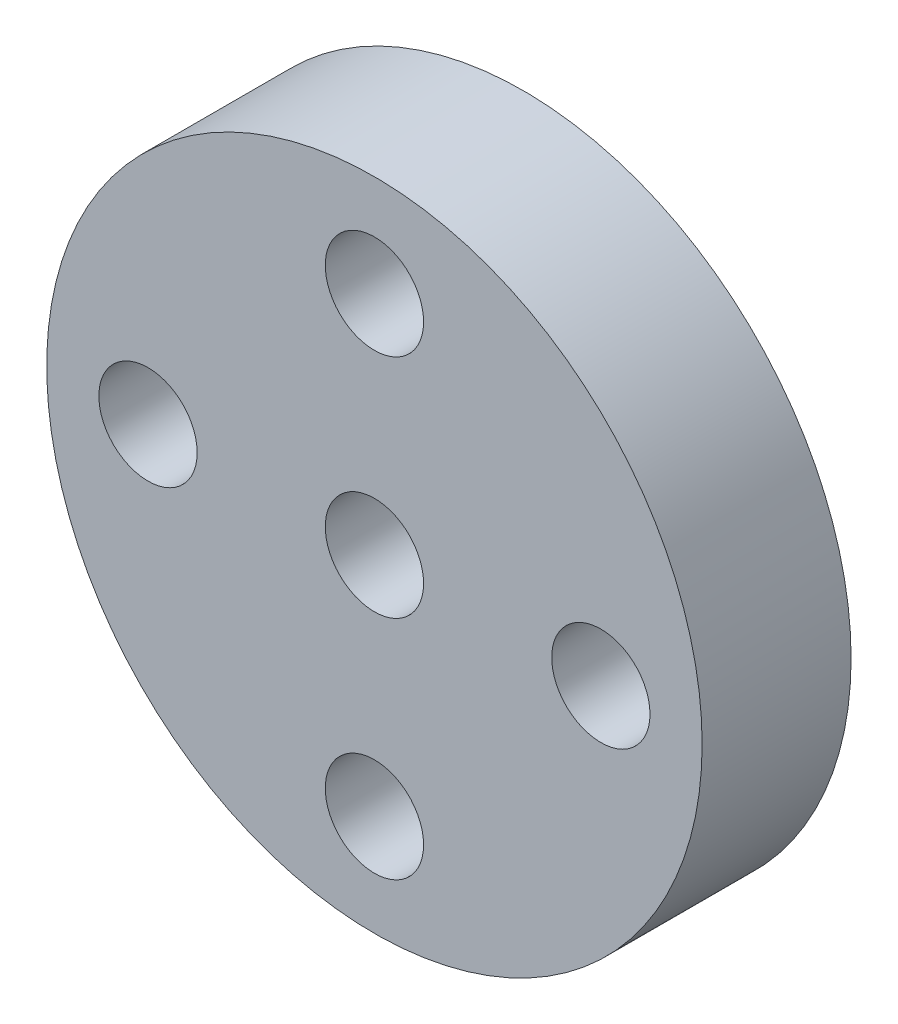
ISO-10303-21;
HEADER;
FILE_DESCRIPTION(('STEP AP214'),'2;1');
FILE_NAME('part.step','',(''),(''),'','','');
FILE_SCHEMA(('AUTOMOTIVE_DESIGN { 1 0 10303 214 1 1 1 1 }'));
ENDSEC;
DATA;
#1=APPLICATION_CONTEXT('core data for automotive mechanical design processes');
#2=APPLICATION_PROTOCOL_DEFINITION('international standard','automotive_design',2000,#1);
#3=PRODUCT_CONTEXT('',#1,'mechanical');
#4=PRODUCT('Part','Part','',(#3));
#5=PRODUCT_RELATED_PRODUCT_CATEGORY('part','',(#4));
#6=PRODUCT_DEFINITION_FORMATION('','',#4);
#7=PRODUCT_DEFINITION_CONTEXT('part definition',#1,'design');
#8=PRODUCT_DEFINITION('design','',#6,#7);
#9=PRODUCT_DEFINITION_SHAPE('','',#8);
#10=(LENGTH_UNIT() NAMED_UNIT(*) SI_UNIT(.MILLI.,.METRE.));
#11=(NAMED_UNIT(*) PLANE_ANGLE_UNIT() SI_UNIT($,.RADIAN.));
#12=(NAMED_UNIT(*) SI_UNIT($,.STERADIAN.) SOLID_ANGLE_UNIT());
#13=UNCERTAINTY_MEASURE_WITH_UNIT(LENGTH_MEASURE(1.E-05),#10,'distance_accuracy_value','');
#14=(GEOMETRIC_REPRESENTATION_CONTEXT(3) GLOBAL_UNCERTAINTY_ASSIGNED_CONTEXT((#13)) GLOBAL_UNIT_ASSIGNED_CONTEXT((#10,
#11,#12)) REPRESENTATION_CONTEXT('',''));
#15=CARTESIAN_POINT('',(0.,0.,0.));
#16=DIRECTION('',(0.,0.,1.));
#17=DIRECTION('',(1.,0.,0.));
#18=AXIS2_PLACEMENT_3D('',#15,#16,#17);
#19=CARTESIAN_POINT('',(-8.43731841304004,0.250726347839904,5.));
#20=DIRECTION('',(0.,0.,-1.));
#21=DIRECTION('',(-1.,0.,0.));
#22=AXIS2_PLACEMENT_3D('',#19,#20,#21);
#23=CYLINDRICAL_SURFACE('',#22,11.);
#24=CARTESIAN_POINT('',(-8.43731841304004,0.250726347839904,5.));
#25=DIRECTION('',(0.,0.,1.));
#26=DIRECTION('',(1.,0.,0.));
#27=AXIS2_PLACEMENT_3D('',#24,#25,#26);
#28=CIRCLE('',#27,11.);
#29=CARTESIAN_POINT('',(2.56268158695995,0.250726347839904,5.));
#30=VERTEX_POINT('',#29);
#31=EDGE_CURVE('E10',#30,#30,#28,.T.);
#32=ORIENTED_EDGE('',*,*,#31,.F.);
#33=EDGE_LOOP('',(#32));
#34=FACE_BOUND('',#33,.T.);
#35=CARTESIAN_POINT('',(-8.43731841304004,0.250726347839904,0.));
#36=DIRECTION('',(0.,0.,1.));
#37=DIRECTION('',(1.,0.,0.));
#38=AXIS2_PLACEMENT_3D('',#35,#36,#37);
#39=CIRCLE('',#38,11.);
#40=CARTESIAN_POINT('',(2.56268158695995,0.250726347839904,0.));
#41=VERTEX_POINT('',#40);
#42=EDGE_CURVE('E42',#41,#41,#39,.T.);
#43=ORIENTED_EDGE('',*,*,#42,.T.);
#44=EDGE_LOOP('',(#43));
#45=FACE_BOUND('',#44,.T.);
#46=ADVANCED_FACE('F35',(#34,#45),#23,.T.);
#47=CARTESIAN_POINT('',(0.,0.,5.));
#48=DIRECTION('',(0.,0.,1.));
#49=DIRECTION('',(1.,0.,0.));
#50=AXIS2_PLACEMENT_3D('',#47,#48,#49);
#51=PLANE('',#50);
#52=CARTESIAN_POINT('',(-0.837318413040043,0.250726347839904,5.));
#53=DIRECTION('',(0.,0.,1.));
#54=DIRECTION('',(1.,0.,0.));
#55=AXIS2_PLACEMENT_3D('',#52,#53,#54);
#56=CIRCLE('',#55,1.65);
#57=CARTESIAN_POINT('',(0.812681586959958,0.250726347839904,5.));
#58=VERTEX_POINT('',#57);
#59=EDGE_CURVE('E56',#58,#58,#56,.T.);
#60=ORIENTED_EDGE('',*,*,#59,.F.);
#61=EDGE_LOOP('',(#60));
#62=FACE_BOUND('',#61,.T.);
#63=CARTESIAN_POINT('',(-8.43731841304004,-7.3492736521601,5.));
#64=DIRECTION('',(0.,0.,1.));
#65=DIRECTION('',(1.,0.,0.));
#66=AXIS2_PLACEMENT_3D('',#63,#64,#65);
#67=CIRCLE('',#66,1.65);
#68=CARTESIAN_POINT('',(-6.78731841304004,-7.3492736521601,5.));
#69=VERTEX_POINT('',#68);
#70=EDGE_CURVE('E122',#69,#69,#67,.T.);
#71=ORIENTED_EDGE('',*,*,#70,.F.);
#72=EDGE_LOOP('',(#71));
#73=FACE_BOUND('',#72,.T.);
#74=CARTESIAN_POINT('',(-16.03731841304,0.250726347839902,5.));
#75=DIRECTION('',(0.,0.,1.));
#76=DIRECTION('',(1.,0.,0.));
#77=AXIS2_PLACEMENT_3D('',#74,#75,#76);
#78=CIRCLE('',#77,1.65);
#79=CARTESIAN_POINT('',(-14.38731841304,0.250726347839902,5.));
#80=VERTEX_POINT('',#79);
#81=EDGE_CURVE('E112',#80,#80,#78,.T.);
#82=ORIENTED_EDGE('',*,*,#81,.F.);
#83=EDGE_LOOP('',(#82));
#84=FACE_BOUND('',#83,.T.);
#85=CARTESIAN_POINT('',(-8.43731841304004,7.85072634783991,5.));
#86=DIRECTION('',(0.,0.,1.));
#87=DIRECTION('',(1.,0.,0.));
#88=AXIS2_PLACEMENT_3D('',#85,#86,#87);
#89=CIRCLE('',#88,1.65);
#90=CARTESIAN_POINT('',(-6.78731841304004,7.85072634783991,5.));
#91=VERTEX_POINT('',#90);
#92=EDGE_CURVE('E49',#91,#91,#89,.T.);
#93=ORIENTED_EDGE('',*,*,#92,.F.);
#94=EDGE_LOOP('',(#93));
#95=FACE_BOUND('',#94,.T.);
#96=CARTESIAN_POINT('',(-8.43731841304004,0.250726347839904,5.));
#97=DIRECTION('',(0.,0.,1.));
#98=DIRECTION('',(1.,0.,0.));
#99=AXIS2_PLACEMENT_3D('',#96,#97,#98);
#100=CIRCLE('',#99,1.65);
#101=CARTESIAN_POINT('',(-6.78731841304004,0.250726347839904,5.));
#102=VERTEX_POINT('',#101);
#103=EDGE_CURVE('E125',#102,#102,#100,.T.);
#104=ORIENTED_EDGE('',*,*,#103,.F.);
#105=EDGE_LOOP('',(#104));
#106=FACE_BOUND('',#105,.T.);
#107=ORIENTED_EDGE('',*,*,#31,.T.);
#108=EDGE_LOOP('',(#107));
#109=FACE_BOUND('',#108,.T.);
#110=ADVANCED_FACE('F84',(#62,#73,#84,#95,#106,#109),#51,.T.);
#111=CARTESIAN_POINT('',(0.,0.,0.));
#112=DIRECTION('',(0.,0.,1.));
#113=DIRECTION('',(1.,0.,0.));
#114=AXIS2_PLACEMENT_3D('',#111,#112,#113);
#115=PLANE('',#114);
#116=CARTESIAN_POINT('',(-0.837318413040043,0.250726347839904,0.));
#117=DIRECTION('',(0.,0.,1.));
#118=DIRECTION('',(1.,0.,0.));
#119=AXIS2_PLACEMENT_3D('',#116,#117,#118);
#120=CIRCLE('',#119,1.65);
#121=CARTESIAN_POINT('',(0.812681586959958,0.250726347839904,0.));
#122=VERTEX_POINT('',#121);
#123=EDGE_CURVE('E38',#122,#122,#120,.T.);
#124=ORIENTED_EDGE('',*,*,#123,.T.);
#125=EDGE_LOOP('',(#124));
#126=FACE_BOUND('',#125,.T.);
#127=CARTESIAN_POINT('',(-8.43731841304004,-7.3492736521601,0.));
#128=DIRECTION('',(0.,0.,1.));
#129=DIRECTION('',(1.,0.,0.));
#130=AXIS2_PLACEMENT_3D('',#127,#128,#129);
#131=CIRCLE('',#130,1.65);
#132=CARTESIAN_POINT('',(-6.78731841304004,-7.3492736521601,0.));
#133=VERTEX_POINT('',#132);
#134=EDGE_CURVE('E61',#133,#133,#131,.T.);
#135=ORIENTED_EDGE('',*,*,#134,.T.);
#136=EDGE_LOOP('',(#135));
#137=FACE_BOUND('',#136,.T.);
#138=CARTESIAN_POINT('',(-16.03731841304,0.250726347839902,0.));
#139=DIRECTION('',(0.,0.,1.));
#140=DIRECTION('',(1.,0.,0.));
#141=AXIS2_PLACEMENT_3D('',#138,#139,#140);
#142=CIRCLE('',#141,1.65);
#143=CARTESIAN_POINT('',(-14.38731841304,0.250726347839902,0.));
#144=VERTEX_POINT('',#143);
#145=EDGE_CURVE('E59',#144,#144,#142,.T.);
#146=ORIENTED_EDGE('',*,*,#145,.T.);
#147=EDGE_LOOP('',(#146));
#148=FACE_BOUND('',#147,.T.);
#149=CARTESIAN_POINT('',(-8.43731841304004,7.85072634783991,0.));
#150=DIRECTION('',(0.,0.,1.));
#151=DIRECTION('',(1.,0.,0.));
#152=AXIS2_PLACEMENT_3D('',#149,#150,#151);
#153=CIRCLE('',#152,1.65);
#154=CARTESIAN_POINT('',(-6.78731841304004,7.85072634783991,0.));
#155=VERTEX_POINT('',#154);
#156=EDGE_CURVE('E55',#155,#155,#153,.T.);
#157=ORIENTED_EDGE('',*,*,#156,.T.);
#158=EDGE_LOOP('',(#157));
#159=FACE_BOUND('',#158,.T.);
#160=CARTESIAN_POINT('',(-8.43731841304004,0.250726347839904,0.));
#161=DIRECTION('',(0.,0.,1.));
#162=DIRECTION('',(1.,0.,0.));
#163=AXIS2_PLACEMENT_3D('',#160,#161,#162);
#164=CIRCLE('',#163,1.65);
#165=CARTESIAN_POINT('',(-6.78731841304004,0.250726347839904,0.));
#166=VERTEX_POINT('',#165);
#167=EDGE_CURVE('E52',#166,#166,#164,.T.);
#168=ORIENTED_EDGE('',*,*,#167,.T.);
#169=EDGE_LOOP('',(#168));
#170=FACE_BOUND('',#169,.T.);
#171=ORIENTED_EDGE('',*,*,#42,.F.);
#172=EDGE_LOOP('',(#171));
#173=FACE_BOUND('',#172,.T.);
#174=ADVANCED_FACE('F68',(#126,#137,#148,#159,#170,#173),#115,.F.);
#175=CARTESIAN_POINT('',(-8.43731841304004,0.250726347839904,-16.));
#176=DIRECTION('',(0.,0.,1.));
#177=DIRECTION('',(1.,0.,0.));
#178=AXIS2_PLACEMENT_3D('',#175,#176,#177);
#179=CYLINDRICAL_SURFACE('',#178,1.65);
#180=ORIENTED_EDGE('',*,*,#103,.T.);
#181=EDGE_LOOP('',(#180));
#182=FACE_BOUND('',#181,.T.);
#183=ORIENTED_EDGE('',*,*,#167,.F.);
#184=EDGE_LOOP('',(#183));
#185=FACE_BOUND('',#184,.T.);
#186=ADVANCED_FACE('F95',(#182,#185),#179,.F.);
#187=CARTESIAN_POINT('',(-8.43731841304004,7.85072634783991,-16.));
#188=DIRECTION('',(0.,0.,1.));
#189=DIRECTION('',(1.,0.,0.));
#190=AXIS2_PLACEMENT_3D('',#187,#188,#189);
#191=CYLINDRICAL_SURFACE('',#190,1.65);
#192=ORIENTED_EDGE('',*,*,#92,.T.);
#193=EDGE_LOOP('',(#192));
#194=FACE_BOUND('',#193,.T.);
#195=ORIENTED_EDGE('',*,*,#156,.F.);
#196=EDGE_LOOP('',(#195));
#197=FACE_BOUND('',#196,.T.);
#198=ADVANCED_FACE('F99',(#194,#197),#191,.F.);
#199=CARTESIAN_POINT('',(-16.03731841304,0.250726347839902,-16.));
#200=DIRECTION('',(0.,0.,1.));
#201=DIRECTION('',(1.,0.,0.));
#202=AXIS2_PLACEMENT_3D('',#199,#200,#201);
#203=CYLINDRICAL_SURFACE('',#202,1.65);
#204=ORIENTED_EDGE('',*,*,#81,.T.);
#205=EDGE_LOOP('',(#204));
#206=FACE_BOUND('',#205,.T.);
#207=ORIENTED_EDGE('',*,*,#145,.F.);
#208=EDGE_LOOP('',(#207));
#209=FACE_BOUND('',#208,.T.);
#210=ADVANCED_FACE('F78',(#206,#209),#203,.F.);
#211=CARTESIAN_POINT('',(-8.43731841304004,-7.3492736521601,-16.));
#212=DIRECTION('',(0.,0.,1.));
#213=DIRECTION('',(1.,0.,0.));
#214=AXIS2_PLACEMENT_3D('',#211,#212,#213);
#215=CYLINDRICAL_SURFACE('',#214,1.65);
#216=ORIENTED_EDGE('',*,*,#70,.T.);
#217=EDGE_LOOP('',(#216));
#218=FACE_BOUND('',#217,.T.);
#219=ORIENTED_EDGE('',*,*,#134,.F.);
#220=EDGE_LOOP('',(#219));
#221=FACE_BOUND('',#220,.T.);
#222=ADVANCED_FACE('F72',(#218,#221),#215,.F.);
#223=CARTESIAN_POINT('',(-0.837318413040043,0.250726347839904,-16.));
#224=DIRECTION('',(0.,0.,1.));
#225=DIRECTION('',(1.,0.,0.));
#226=AXIS2_PLACEMENT_3D('',#223,#224,#225);
#227=CYLINDRICAL_SURFACE('',#226,1.65);
#228=ORIENTED_EDGE('',*,*,#59,.T.);
#229=EDGE_LOOP('',(#228));
#230=FACE_BOUND('',#229,.T.);
#231=ORIENTED_EDGE('',*,*,#123,.F.);
#232=EDGE_LOOP('',(#231));
#233=FACE_BOUND('',#232,.T.);
#234=ADVANCED_FACE('F70',(#230,#233),#227,.F.);
#235=CLOSED_SHELL('',(#46,#110,#174,#186,#198,#210,#222,#234));
#236=MANIFOLD_SOLID_BREP('B2',#235);
#237=ADVANCED_BREP_SHAPE_REPRESENTATION('',(#18,#236),#14);
#238=SHAPE_DEFINITION_REPRESENTATION(#9,#237);
ENDSEC;
END-ISO-10303-21;
